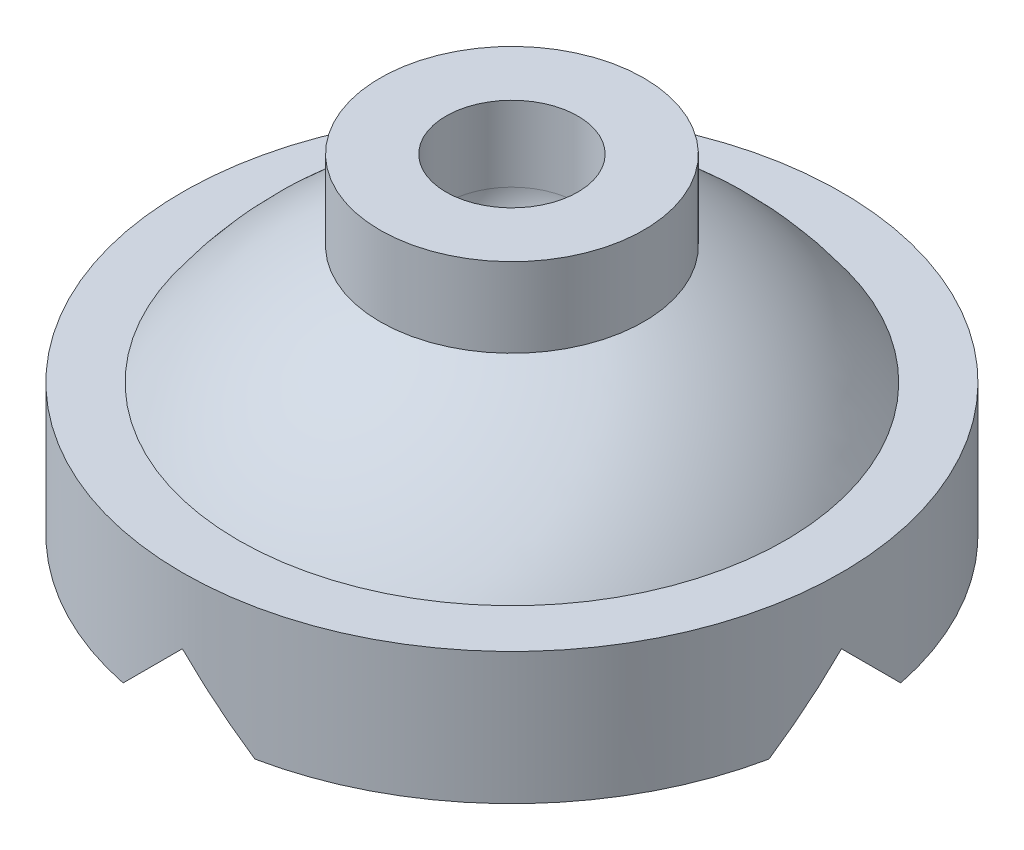
ISO-10303-21;
HEADER;
FILE_DESCRIPTION(('STEP AP214'),'2;1');
FILE_NAME('part.step','',(''),(''),'','','');
FILE_SCHEMA(('AUTOMOTIVE_DESIGN { 1 0 10303 214 1 1 1 1 }'));
ENDSEC;
DATA;
#1=APPLICATION_CONTEXT('core data for automotive mechanical design processes');
#2=APPLICATION_PROTOCOL_DEFINITION('international standard','automotive_design',2000,#1);
#3=PRODUCT_CONTEXT('',#1,'mechanical');
#4=PRODUCT('Part','Part','',(#3));
#5=PRODUCT_RELATED_PRODUCT_CATEGORY('part','',(#4));
#6=PRODUCT_DEFINITION_FORMATION('','',#4);
#7=PRODUCT_DEFINITION_CONTEXT('part definition',#1,'design');
#8=PRODUCT_DEFINITION('design','',#6,#7);
#9=PRODUCT_DEFINITION_SHAPE('','',#8);
#10=(LENGTH_UNIT() NAMED_UNIT(*) SI_UNIT(.MILLI.,.METRE.));
#11=(NAMED_UNIT(*) PLANE_ANGLE_UNIT() SI_UNIT($,.RADIAN.));
#12=(NAMED_UNIT(*) SI_UNIT($,.STERADIAN.) SOLID_ANGLE_UNIT());
#13=UNCERTAINTY_MEASURE_WITH_UNIT(LENGTH_MEASURE(1.E-05),#10,'distance_accuracy_value','');
#14=(GEOMETRIC_REPRESENTATION_CONTEXT(3) GLOBAL_UNCERTAINTY_ASSIGNED_CONTEXT((#13)) GLOBAL_UNIT_ASSIGNED_CONTEXT((#10,
#11,#12)) REPRESENTATION_CONTEXT('',''));
#15=CARTESIAN_POINT('',(0.,0.,0.));
#16=DIRECTION('',(0.,0.,1.));
#17=DIRECTION('',(1.,0.,0.));
#18=AXIS2_PLACEMENT_3D('',#15,#16,#17);
#19=CARTESIAN_POINT('',(0.,0.,0.));
#20=DIRECTION('',(0.,1.,0.));
#21=DIRECTION('',(0.,0.,1.));
#22=AXIS2_PLACEMENT_3D('',#19,#20,#21);
#23=PLANE('',#22);
#24=CARTESIAN_POINT('',(0.,0.,0.));
#25=DIRECTION('',(0.,1.,0.));
#26=DIRECTION('',(0.,0.,1.));
#27=AXIS2_PLACEMENT_3D('',#24,#25,#26);
#28=CIRCLE('',#27,25.);
#29=CARTESIAN_POINT('',(-24.4948974278318,0.,5.));
#30=VERTEX_POINT('',#29);
#31=CARTESIAN_POINT('',(-5.,0.,24.4948974278318));
#32=VERTEX_POINT('',#31);
#33=EDGE_CURVE('E166',#30,#32,#28,.T.);
#34=ORIENTED_EDGE('',*,*,#33,.F.);
#35=DIRECTION('',(1.,0.,0.));
#36=VECTOR('',#35,1.);
#37=CARTESIAN_POINT('',(-25.,0.,5.));
#38=LINE('',#37,#36);
#39=CARTESIAN_POINT('',(-5.00000000000002,0.,5.00000000000001));
#40=VERTEX_POINT('',#39);
#41=EDGE_CURVE('E186',#30,#40,#38,.T.);
#42=ORIENTED_EDGE('',*,*,#41,.T.);
#43=DIRECTION('',(0.,0.,1.));
#44=VECTOR('',#43,1.);
#45=CARTESIAN_POINT('',(-5.,0.,-30.));
#46=LINE('',#45,#44);
#47=EDGE_CURVE('E135',#40,#32,#46,.T.);
#48=ORIENTED_EDGE('',*,*,#47,.T.);
#49=EDGE_LOOP('',(#34,#42,#48));
#50=FACE_BOUND('',#49,.T.);
#51=ADVANCED_FACE('F34',(#50),#23,.F.);
#52=DIRECTION('',(0.,0.,1.));
#53=VECTOR('',#52,1.);
#54=CARTESIAN_POINT('',(5.,0.,-30.));
#55=LINE('',#54,#53);
#56=CARTESIAN_POINT('',(5.,0.,5.));
#57=VERTEX_POINT('',#56);
#58=CARTESIAN_POINT('',(5.,0.,24.4948974278318));
#59=VERTEX_POINT('',#58);
#60=EDGE_CURVE('E145',#57,#59,#55,.T.);
#61=ORIENTED_EDGE('',*,*,#60,.F.);
#62=CARTESIAN_POINT('',(24.4948974278318,0.,5.));
#63=VERTEX_POINT('',#62);
#64=EDGE_CURVE('E185',#57,#63,#38,.T.);
#65=ORIENTED_EDGE('',*,*,#64,.T.);
#66=EDGE_CURVE('E131',#59,#63,#28,.T.);
#67=ORIENTED_EDGE('',*,*,#66,.F.);
#68=EDGE_LOOP('',(#61,#65,#67));
#69=FACE_BOUND('',#68,.T.);
#70=ADVANCED_FACE('F184',(#69),#23,.F.);
#71=CARTESIAN_POINT('',(0.,5.,-30.));
#72=DIRECTION('',(-0.707106781186548,0.707106781186548,0.));
#73=DIRECTION('',(-0.707106781186548,-0.707106781186548,0.));
#74=AXIS2_PLACEMENT_3D('',#71,#72,#73);
#75=PLANE('',#74);
#76=ORIENTED_EDGE('',*,*,#47,.F.);
#77=DIRECTION('',(0.577350269189626,0.577350269189626,-0.577350269189626));
#78=VECTOR('',#77,1.);
#79=CARTESIAN_POINT('',(10.,15.,-10.));
#80=LINE('',#79,#78);
#81=CARTESIAN_POINT('',(0.,5.,0.));
#82=VERTEX_POINT('',#81);
#83=EDGE_CURVE('E117',#40,#82,#80,.T.);
#84=ORIENTED_EDGE('',*,*,#83,.T.);
#85=DIRECTION('',(0.,0.,1.));
#86=VECTOR('',#85,1.);
#87=CARTESIAN_POINT('',(0.,5.,-30.));
#88=LINE('',#87,#86);
#89=CARTESIAN_POINT('',(0.,5.,25.));
#90=VERTEX_POINT('',#89);
#91=EDGE_CURVE('E141',#82,#90,#88,.T.);
#92=ORIENTED_EDGE('',*,*,#91,.T.);
#93=CARTESIAN_POINT('',(0.,5.,0.));
#94=DIRECTION('',(-0.707106781186548,0.707106781186548,0.));
#95=DIRECTION('',(0.707106781186548,0.707106781186548,0.));
#96=AXIS2_PLACEMENT_3D('',#93,#94,#95);
#97=ELLIPSE('',#96,35.3553390593274,25.);
#98=EDGE_CURVE('E176',#32,#90,#97,.T.);
#99=ORIENTED_EDGE('',*,*,#98,.F.);
#100=EDGE_LOOP('',(#76,#84,#92,#99));
#101=FACE_BOUND('',#100,.T.);
#102=ADVANCED_FACE('F210',(#101),#75,.F.);
#103=CARTESIAN_POINT('',(5.,0.,-30.));
#104=DIRECTION('',(0.707106781186547,0.707106781186548,0.));
#105=DIRECTION('',(-0.707106781186548,0.707106781186547,0.));
#106=AXIS2_PLACEMENT_3D('',#103,#104,#105);
#107=PLANE('',#106);
#108=ORIENTED_EDGE('',*,*,#91,.F.);
#109=DIRECTION('',(0.577350269189626,-0.577350269189626,0.577350269189626));
#110=VECTOR('',#109,1.);
#111=CARTESIAN_POINT('',(-6.66666666666667,11.6666666666667,-6.66666666666667));
#112=LINE('',#111,#110);
#113=EDGE_CURVE('E11',#82,#57,#112,.T.);
#114=ORIENTED_EDGE('',*,*,#113,.T.);
#115=ORIENTED_EDGE('',*,*,#60,.T.);
#116=CARTESIAN_POINT('',(0.,5.,0.));
#117=DIRECTION('',(0.707106781186547,0.707106781186548,0.));
#118=DIRECTION('',(-0.707106781186548,0.707106781186547,0.));
#119=AXIS2_PLACEMENT_3D('',#116,#117,#118);
#120=ELLIPSE('',#119,35.3553390593274,25.);
#121=EDGE_CURVE('E174',#90,#59,#120,.T.);
#122=ORIENTED_EDGE('',*,*,#121,.F.);
#123=EDGE_LOOP('',(#108,#114,#115,#122));
#124=FACE_BOUND('',#123,.T.);
#125=ADVANCED_FACE('F211',(#124),#107,.F.);
#126=CARTESIAN_POINT('',(-5.,0.,-24.4948974278318));
#127=VERTEX_POINT('',#126);
#128=CARTESIAN_POINT('',(-5.,0.,-5.));
#129=VERTEX_POINT('',#128);
#130=EDGE_CURVE('E146',#127,#129,#46,.T.);
#131=ORIENTED_EDGE('',*,*,#130,.T.);
#132=DIRECTION('',(1.,0.,0.));
#133=VECTOR('',#132,1.);
#134=CARTESIAN_POINT('',(-25.,0.,-5.));
#135=LINE('',#134,#133);
#136=CARTESIAN_POINT('',(-24.4948974278318,0.,-5.));
#137=VERTEX_POINT('',#136);
#138=EDGE_CURVE('E124',#137,#129,#135,.T.);
#139=ORIENTED_EDGE('',*,*,#138,.F.);
#140=EDGE_CURVE('E170',#127,#137,#28,.T.);
#141=ORIENTED_EDGE('',*,*,#140,.F.);
#142=EDGE_LOOP('',(#131,#139,#141));
#143=FACE_BOUND('',#142,.T.);
#144=ADVANCED_FACE('F200',(#143),#23,.F.);
#145=CARTESIAN_POINT('',(24.4948974278318,0.,-5.));
#146=VERTEX_POINT('',#145);
#147=CARTESIAN_POINT('',(5.,0.,-24.4948974278318));
#148=VERTEX_POINT('',#147);
#149=EDGE_CURVE('E169',#146,#148,#28,.T.);
#150=ORIENTED_EDGE('',*,*,#149,.F.);
#151=CARTESIAN_POINT('',(4.99999999999999,0.,-5.));
#152=VERTEX_POINT('',#151);
#153=EDGE_CURVE('E113',#152,#146,#135,.T.);
#154=ORIENTED_EDGE('',*,*,#153,.F.);
#155=EDGE_CURVE('E142',#148,#152,#55,.T.);
#156=ORIENTED_EDGE('',*,*,#155,.F.);
#157=EDGE_LOOP('',(#150,#154,#156));
#158=FACE_BOUND('',#157,.T.);
#159=ADVANCED_FACE('F36',(#158),#23,.F.);
#160=CARTESIAN_POINT('',(0.,30.0680850960464,0.));
#161=DIRECTION('',(0.,1.,0.));
#162=DIRECTION('',(0.,0.,1.));
#163=AXIS2_PLACEMENT_3D('',#160,#161,#162);
#164=CYLINDRICAL_SURFACE('',#163,25.);
#165=CARTESIAN_POINT('',(0.,10.,0.));
#166=DIRECTION('',(0.,1.,0.));
#167=DIRECTION('',(0.,0.,1.));
#168=AXIS2_PLACEMENT_3D('',#165,#166,#167);
#169=CIRCLE('',#168,25.);
#170=CARTESIAN_POINT('',(0.,10.,25.));
#171=VERTEX_POINT('',#170);
#172=EDGE_CURVE('E163',#171,#171,#169,.T.);
#173=ORIENTED_EDGE('',*,*,#172,.F.);
#174=EDGE_LOOP('',(#173));
#175=FACE_BOUND('',#174,.T.);
#176=CARTESIAN_POINT('',(0.,5.,0.));
#177=DIRECTION('',(0.,0.707106781186548,-0.707106781186547));
#178=DIRECTION('',(0.,0.707106781186547,0.707106781186548));
#179=AXIS2_PLACEMENT_3D('',#176,#177,#178);
#180=ELLIPSE('',#179,35.3553390593274,25.);
#181=CARTESIAN_POINT('',(-25.,5.,0.));
#182=VERTEX_POINT('',#181);
#183=EDGE_CURVE('E118',#137,#182,#180,.T.);
#184=ORIENTED_EDGE('',*,*,#183,.T.);
#185=CARTESIAN_POINT('',(0.,5.,0.));
#186=DIRECTION('',(0.,0.707106781186548,0.707106781186547));
#187=DIRECTION('',(0.,0.707106781186547,-0.707106781186548));
#188=AXIS2_PLACEMENT_3D('',#185,#186,#187);
#189=ELLIPSE('',#188,35.3553390593274,25.);
#190=EDGE_CURVE('E132',#182,#30,#189,.T.);
#191=ORIENTED_EDGE('',*,*,#190,.T.);
#192=ORIENTED_EDGE('',*,*,#33,.T.);
#193=ORIENTED_EDGE('',*,*,#98,.T.);
#194=ORIENTED_EDGE('',*,*,#121,.T.);
#195=ORIENTED_EDGE('',*,*,#66,.T.);
#196=CARTESIAN_POINT('',(25.,5.,0.));
#197=VERTEX_POINT('',#196);
#198=EDGE_CURVE('E122',#63,#197,#189,.T.);
#199=ORIENTED_EDGE('',*,*,#198,.T.);
#200=EDGE_CURVE('E107',#197,#146,#180,.T.);
#201=ORIENTED_EDGE('',*,*,#200,.T.);
#202=ORIENTED_EDGE('',*,*,#149,.T.);
#203=CARTESIAN_POINT('',(0.,5.,-25.));
#204=VERTEX_POINT('',#203);
#205=EDGE_CURVE('E168',#148,#204,#120,.T.);
#206=ORIENTED_EDGE('',*,*,#205,.T.);
#207=EDGE_CURVE('E173',#204,#127,#97,.T.);
#208=ORIENTED_EDGE('',*,*,#207,.T.);
#209=ORIENTED_EDGE('',*,*,#140,.T.);
#210=EDGE_LOOP('',(#184,#191,#192,#193,#194,#195,#199,#201,#202,#206,#208,#209));
#211=FACE_BOUND('',#210,.T.);
#212=ADVANCED_FACE('F128',(#175,#211),#164,.T.);
#213=CARTESIAN_POINT('',(0.,10.,-25.));
#214=DIRECTION('',(0.,-1.,0.));
#215=DIRECTION('',(0.,0.,-1.));
#216=AXIS2_PLACEMENT_3D('',#213,#214,#215);
#217=PLANE('',#216);
#218=CARTESIAN_POINT('',(0.,10.,0.));
#219=DIRECTION('',(0.,1.,0.));
#220=DIRECTION('',(0.,0.,1.));
#221=AXIS2_PLACEMENT_3D('',#218,#219,#220);
#222=CIRCLE('',#221,20.7483400923221);
#223=CARTESIAN_POINT('',(0.,10.,20.7483400923221));
#224=VERTEX_POINT('',#223);
#225=EDGE_CURVE('E160',#224,#224,#222,.T.);
#226=ORIENTED_EDGE('',*,*,#225,.F.);
#227=EDGE_LOOP('',(#226));
#228=FACE_BOUND('',#227,.T.);
#229=ORIENTED_EDGE('',*,*,#172,.T.);
#230=EDGE_LOOP('',(#229));
#231=FACE_BOUND('',#230,.T.);
#232=ADVANCED_FACE('F229',(#228,#231),#217,.F.);
#233=CARTESIAN_POINT('',(0.,-5.09409641595939,0.));
#234=DIRECTION('',(0.,1.,0.));
#235=DIRECTION('',(0.,0.,1.));
#236=AXIS2_PLACEMENT_3D('',#233,#234,#235);
#237=DEGENERATE_TOROIDAL_SURFACE('',#236,0.990766293587225,26.4654584897402,.F.);
#238=CARTESIAN_POINT('',(0.,18.981275841846,0.));
#239=DIRECTION('',(0.,1.,0.));
#240=DIRECTION('',(0.,0.,1.));
#241=AXIS2_PLACEMENT_3D('',#238,#239,#240);
#242=CIRCLE('',#241,10.);
#243=CARTESIAN_POINT('',(0.,18.981275841846,10.));
#244=VERTEX_POINT('',#243);
#245=EDGE_CURVE('E157',#244,#244,#242,.T.);
#246=ORIENTED_EDGE('',*,*,#245,.F.);
#247=EDGE_LOOP('',(#246));
#248=FACE_BOUND('',#247,.T.);
#249=ORIENTED_EDGE('',*,*,#225,.T.);
#250=EDGE_LOOP('',(#249));
#251=FACE_BOUND('',#250,.T.);
#252=ADVANCED_FACE('F234',(#248,#251),#237,.F.);
#253=CARTESIAN_POINT('',(0.,30.0680850960464,0.));
#254=DIRECTION('',(0.,1.,0.));
#255=DIRECTION('',(0.,0.,1.));
#256=AXIS2_PLACEMENT_3D('',#253,#254,#255);
#257=CYLINDRICAL_SURFACE('',#256,10.);
#258=CARTESIAN_POINT('',(0.,25.,0.));
#259=DIRECTION('',(0.,1.,0.));
#260=DIRECTION('',(0.,0.,1.));
#261=AXIS2_PLACEMENT_3D('',#258,#259,#260);
#262=CIRCLE('',#261,10.);
#263=CARTESIAN_POINT('',(0.,25.,10.));
#264=VERTEX_POINT('',#263);
#265=EDGE_CURVE('E154',#264,#264,#262,.T.);
#266=ORIENTED_EDGE('',*,*,#265,.F.);
#267=EDGE_LOOP('',(#266));
#268=FACE_BOUND('',#267,.T.);
#269=ORIENTED_EDGE('',*,*,#245,.T.);
#270=EDGE_LOOP('',(#269));
#271=FACE_BOUND('',#270,.T.);
#272=ADVANCED_FACE('F241',(#268,#271),#257,.T.);
#273=CARTESIAN_POINT('',(0.,25.,-10.));
#274=DIRECTION('',(0.,-1.,0.));
#275=DIRECTION('',(0.,0.,-1.));
#276=AXIS2_PLACEMENT_3D('',#273,#274,#275);
#277=PLANE('',#276);
#278=CARTESIAN_POINT('',(0.,25.,0.));
#279=DIRECTION('',(0.,1.,0.));
#280=DIRECTION('',(0.,0.,1.));
#281=AXIS2_PLACEMENT_3D('',#278,#279,#280);
#282=CIRCLE('',#281,5.);
#283=CARTESIAN_POINT('',(0.,25.,5.));
#284=VERTEX_POINT('',#283);
#285=EDGE_CURVE('E151',#284,#284,#282,.T.);
#286=ORIENTED_EDGE('',*,*,#285,.F.);
#287=EDGE_LOOP('',(#286));
#288=FACE_BOUND('',#287,.T.);
#289=ORIENTED_EDGE('',*,*,#265,.T.);
#290=EDGE_LOOP('',(#289));
#291=FACE_BOUND('',#290,.T.);
#292=ADVANCED_FACE('F245',(#288,#291),#277,.F.);
#293=CARTESIAN_POINT('',(0.,30.0680850960464,0.));
#294=DIRECTION('',(0.,1.,0.));
#295=DIRECTION('',(0.,0.,1.));
#296=AXIS2_PLACEMENT_3D('',#293,#294,#295);
#297=CYLINDRICAL_SURFACE('',#296,5.);
#298=CARTESIAN_POINT('',(0.,19.290902348331,0.));
#299=DIRECTION('',(0.,1.,0.));
#300=DIRECTION('',(0.,0.,1.));
#301=AXIS2_PLACEMENT_3D('',#298,#299,#300);
#302=CIRCLE('',#301,5.);
#303=CARTESIAN_POINT('',(0.,19.290902348331,5.));
#304=VERTEX_POINT('',#303);
#305=EDGE_CURVE('E140',#304,#304,#302,.T.);
#306=ORIENTED_EDGE('',*,*,#305,.F.);
#307=EDGE_LOOP('',(#306));
#308=FACE_BOUND('',#307,.T.);
#309=ORIENTED_EDGE('',*,*,#285,.T.);
#310=EDGE_LOOP('',(#309));
#311=FACE_BOUND('',#310,.T.);
#312=ADVANCED_FACE('F249',(#308,#311),#297,.F.);
#313=CARTESIAN_POINT('',(0.,19.23698067795,-0.0539216703809879));
#314=DIRECTION('',(-1.,0.,0.));
#315=DIRECTION('',(0.,0.,1.));
#316=AXIS2_PLACEMENT_3D('',#313,#314,#315);
#317=CIRCLE('',#316,5.05420931470821);
#318=TRIMMED_CURVE('',#317,(PARAMETER_VALUE(-1.56012745853603)),
(PARAMETER_VALUE(1.56012745853603)),.T.,.PARAMETER.);
#319=CARTESIAN_POINT('',(0.,19.23698067795,0.));
#320=DIRECTION('',(0.,1.,0.));
#321=AXIS1_PLACEMENT('',#319,#320);
#322=SURFACE_OF_REVOLUTION('',#318,#321);
#323=CARTESIAN_POINT('',(0.,14.1830590075691,0.));
#324=VERTEX_POINT('',#323);
#325=VERTEX_LOOP('',#324);
#326=FACE_BOUND('',#325,.T.);
#327=ORIENTED_EDGE('',*,*,#305,.T.);
#328=EDGE_LOOP('',(#327));
#329=FACE_BOUND('',#328,.T.);
#330=ADVANCED_FACE('F253',(#326,#329),#322,.F.);
#331=EDGE_CURVE('E57',#204,#82,#88,.T.);
#332=ORIENTED_EDGE('',*,*,#331,.T.);
#333=DIRECTION('',(-0.577350269189626,-0.577350269189626,-0.577350269189626));
#334=VECTOR('',#333,1.);
#335=CARTESIAN_POINT('',(-10.,-5.,-10.));
#336=LINE('',#335,#334);
#337=EDGE_CURVE('E189',#82,#129,#336,.T.);
#338=ORIENTED_EDGE('',*,*,#337,.T.);
#339=ORIENTED_EDGE('',*,*,#130,.F.);
#340=ORIENTED_EDGE('',*,*,#207,.F.);
#341=EDGE_LOOP('',(#332,#338,#339,#340));
#342=FACE_BOUND('',#341,.T.);
#343=ADVANCED_FACE('F202',(#342),#75,.F.);
#344=ORIENTED_EDGE('',*,*,#155,.T.);
#345=DIRECTION('',(-0.577350269189626,0.577350269189626,0.577350269189626));
#346=VECTOR('',#345,1.);
#347=CARTESIAN_POINT('',(13.3333333333333,-8.33333333333333,-13.3333333333333));
#348=LINE('',#347,#346);
#349=EDGE_CURVE('E42',#152,#82,#348,.T.);
#350=ORIENTED_EDGE('',*,*,#349,.T.);
#351=ORIENTED_EDGE('',*,*,#331,.F.);
#352=ORIENTED_EDGE('',*,*,#205,.F.);
#353=EDGE_LOOP('',(#344,#350,#351,#352));
#354=FACE_BOUND('',#353,.T.);
#355=ADVANCED_FACE('F204',(#354),#107,.F.);
#356=CARTESIAN_POINT('',(-25.,5.,0.));
#357=DIRECTION('',(0.,0.707106781186548,-0.707106781186547));
#358=DIRECTION('',(0.,0.707106781186547,0.707106781186548));
#359=AXIS2_PLACEMENT_3D('',#356,#357,#358);
#360=PLANE('',#359);
#361=DIRECTION('',(1.,0.,0.));
#362=VECTOR('',#361,1.);
#363=CARTESIAN_POINT('',(-25.,5.,0.));
#364=LINE('',#363,#362);
#365=EDGE_CURVE('E110',#82,#197,#364,.T.);
#366=ORIENTED_EDGE('',*,*,#365,.F.);
#367=ORIENTED_EDGE('',*,*,#349,.F.);
#368=ORIENTED_EDGE('',*,*,#153,.T.);
#369=ORIENTED_EDGE('',*,*,#200,.F.);
#370=EDGE_LOOP('',(#366,#367,#368,#369));
#371=FACE_BOUND('',#370,.T.);
#372=ADVANCED_FACE('F109',(#371),#360,.F.);
#373=CARTESIAN_POINT('',(-25.,0.,5.));
#374=DIRECTION('',(0.,0.707106781186548,0.707106781186547));
#375=DIRECTION('',(0.,-0.707106781186547,0.707106781186548));
#376=AXIS2_PLACEMENT_3D('',#373,#374,#375);
#377=PLANE('',#376);
#378=ORIENTED_EDGE('',*,*,#64,.F.);
#379=ORIENTED_EDGE('',*,*,#113,.F.);
#380=ORIENTED_EDGE('',*,*,#365,.T.);
#381=ORIENTED_EDGE('',*,*,#198,.F.);
#382=EDGE_LOOP('',(#378,#379,#380,#381));
#383=FACE_BOUND('',#382,.T.);
#384=ADVANCED_FACE('F121',(#383),#377,.F.);
#385=EDGE_CURVE('E49',#182,#82,#364,.T.);
#386=ORIENTED_EDGE('',*,*,#385,.T.);
#387=ORIENTED_EDGE('',*,*,#83,.F.);
#388=ORIENTED_EDGE('',*,*,#41,.F.);
#389=ORIENTED_EDGE('',*,*,#190,.F.);
#390=EDGE_LOOP('',(#386,#387,#388,#389));
#391=FACE_BOUND('',#390,.T.);
#392=ADVANCED_FACE('F277',(#391),#377,.F.);
#393=ORIENTED_EDGE('',*,*,#138,.T.);
#394=ORIENTED_EDGE('',*,*,#337,.F.);
#395=ORIENTED_EDGE('',*,*,#385,.F.);
#396=ORIENTED_EDGE('',*,*,#183,.F.);
#397=EDGE_LOOP('',(#393,#394,#395,#396));
#398=FACE_BOUND('',#397,.T.);
#399=ADVANCED_FACE('F198',(#398),#360,.F.);
#400=CLOSED_SHELL('',(#51,#70,#102,#125,#144,#159,#212,#232,#252,#272,#292,#312,#330,#343,#355,
#372,#384,#392,#399));
#401=MANIFOLD_SOLID_BREP('B2',#400);
#402=ADVANCED_BREP_SHAPE_REPRESENTATION('',(#18,#401),#14);
#403=SHAPE_DEFINITION_REPRESENTATION(#9,#402);
ENDSEC;
END-ISO-10303-21;
